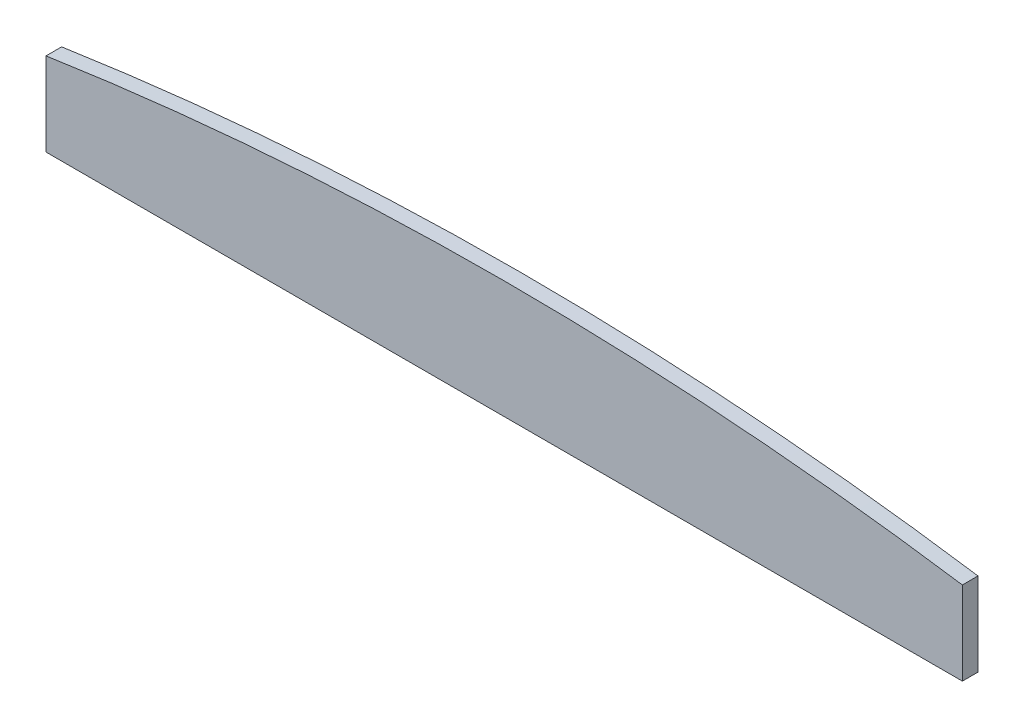
ISO-10303-21;
HEADER;
FILE_DESCRIPTION(('STEP AP214'),'2;1');
FILE_NAME('part.step','',(''),(''),'','','');
FILE_SCHEMA(('AUTOMOTIVE_DESIGN { 1 0 10303 214 1 1 1 1 }'));
ENDSEC;
DATA;
#1=APPLICATION_CONTEXT('core data for automotive mechanical design processes');
#2=APPLICATION_PROTOCOL_DEFINITION('international standard','automotive_design',2000,#1);
#3=PRODUCT_CONTEXT('',#1,'mechanical');
#4=PRODUCT('Part','Part','',(#3));
#5=PRODUCT_RELATED_PRODUCT_CATEGORY('part','',(#4));
#6=PRODUCT_DEFINITION_FORMATION('','',#4);
#7=PRODUCT_DEFINITION_CONTEXT('part definition',#1,'design');
#8=PRODUCT_DEFINITION('design','',#6,#7);
#9=PRODUCT_DEFINITION_SHAPE('','',#8);
#10=(LENGTH_UNIT() NAMED_UNIT(*) SI_UNIT(.MILLI.,.METRE.));
#11=(NAMED_UNIT(*) PLANE_ANGLE_UNIT() SI_UNIT($,.RADIAN.));
#12=(NAMED_UNIT(*) SI_UNIT($,.STERADIAN.) SOLID_ANGLE_UNIT());
#13=UNCERTAINTY_MEASURE_WITH_UNIT(LENGTH_MEASURE(1.E-05),#10,'distance_accuracy_value','');
#14=(GEOMETRIC_REPRESENTATION_CONTEXT(3) GLOBAL_UNCERTAINTY_ASSIGNED_CONTEXT((#13)) GLOBAL_UNIT_ASSIGNED_CONTEXT((#10,
#11,#12)) REPRESENTATION_CONTEXT('',''));
#15=CARTESIAN_POINT('',(0.,0.,0.));
#16=DIRECTION('',(0.,0.,1.));
#17=DIRECTION('',(1.,0.,0.));
#18=AXIS2_PLACEMENT_3D('',#15,#16,#17);
#19=CARTESIAN_POINT('',(58.7,16.,-1.));
#20=DIRECTION('',(-1.,0.,0.));
#21=DIRECTION('',(0.,0.,1.));
#22=AXIS2_PLACEMENT_3D('',#19,#20,#21);
#23=PLANE('',#22);
#24=DIRECTION('',(0.,-1.,0.));
#25=VECTOR('',#24,1.);
#26=CARTESIAN_POINT('',(58.7,16.,-1.));
#27=LINE('',#26,#25);
#28=CARTESIAN_POINT('',(58.7,10.6746827832801,-1.));
#29=VERTEX_POINT('',#28);
#30=CARTESIAN_POINT('',(58.7,0.,-1.));
#31=VERTEX_POINT('',#30);
#32=EDGE_CURVE('E11',#29,#31,#27,.T.);
#33=ORIENTED_EDGE('',*,*,#32,.F.);
#34=DIRECTION('',(0.,0.,1.));
#35=VECTOR('',#34,1.);
#36=CARTESIAN_POINT('',(58.7,10.6746827832801,-19.));
#37=LINE('',#36,#35);
#38=CARTESIAN_POINT('',(58.7,10.6746827832801,1.));
#39=VERTEX_POINT('',#38);
#40=EDGE_CURVE('E76',#29,#39,#37,.T.);
#41=ORIENTED_EDGE('',*,*,#40,.T.);
#42=DIRECTION('',(0.,-1.,0.));
#43=VECTOR('',#42,1.);
#44=CARTESIAN_POINT('',(58.7,16.,1.));
#45=LINE('',#44,#43);
#46=CARTESIAN_POINT('',(58.7,0.,1.));
#47=VERTEX_POINT('',#46);
#48=EDGE_CURVE('E58',#39,#47,#45,.T.);
#49=ORIENTED_EDGE('',*,*,#48,.T.);
#50=DIRECTION('',(0.,0.,-1.));
#51=VECTOR('',#50,1.);
#52=CARTESIAN_POINT('',(58.7,0.,-1.));
#53=LINE('',#52,#51);
#54=EDGE_CURVE('E104',#47,#31,#53,.T.);
#55=ORIENTED_EDGE('',*,*,#54,.T.);
#56=EDGE_LOOP('',(#33,#41,#49,#55));
#57=FACE_BOUND('',#56,.T.);
#58=ADVANCED_FACE('F36',(#57),#23,.F.);
#59=CARTESIAN_POINT('',(-58.7,16.,-1.));
#60=DIRECTION('',(0.,0.,1.));
#61=DIRECTION('',(1.,0.,0.));
#62=AXIS2_PLACEMENT_3D('',#59,#60,#61);
#63=PLANE('',#62);
#64=DIRECTION('',(0.,-1.,0.));
#65=VECTOR('',#64,1.);
#66=CARTESIAN_POINT('',(-58.7,16.,-1.));
#67=LINE('',#66,#65);
#68=CARTESIAN_POINT('',(-58.7,10.6746827832801,-0.999999999999997));
#69=VERTEX_POINT('',#68);
#70=CARTESIAN_POINT('',(-58.7,0.,-1.));
#71=VERTEX_POINT('',#70);
#72=EDGE_CURVE('E43',#69,#71,#67,.T.);
#73=ORIENTED_EDGE('',*,*,#72,.F.);
#74=CARTESIAN_POINT('',(0.,-379.676965642301,-1.));
#75=DIRECTION('',(0.,0.,1.));
#76=DIRECTION('',(1.,0.,0.));
#77=AXIS2_PLACEMENT_3D('',#74,#75,#76);
#78=CIRCLE('',#77,394.740546978098);
#79=EDGE_CURVE('E109',#69,#29,#78,.F.);
#80=ORIENTED_EDGE('',*,*,#79,.T.);
#81=ORIENTED_EDGE('',*,*,#32,.T.);
#82=DIRECTION('',(-1.,0.,0.));
#83=VECTOR('',#82,1.);
#84=CARTESIAN_POINT('',(-58.7,0.,-1.));
#85=LINE('',#84,#83);
#86=EDGE_CURVE('E101',#31,#71,#85,.T.);
#87=ORIENTED_EDGE('',*,*,#86,.T.);
#88=EDGE_LOOP('',(#73,#80,#81,#87));
#89=FACE_BOUND('',#88,.T.);
#90=ADVANCED_FACE('F102',(#89),#63,.F.);
#91=CARTESIAN_POINT('',(-58.7,16.,-1.));
#92=DIRECTION('',(1.,0.,0.));
#93=DIRECTION('',(0.,0.,-1.));
#94=AXIS2_PLACEMENT_3D('',#91,#92,#93);
#95=PLANE('',#94);
#96=DIRECTION('',(0.,-1.,0.));
#97=VECTOR('',#96,1.);
#98=CARTESIAN_POINT('',(-58.7,16.,1.));
#99=LINE('',#98,#97);
#100=CARTESIAN_POINT('',(-58.7,10.6746827832801,1.));
#101=VERTEX_POINT('',#100);
#102=CARTESIAN_POINT('',(-58.7,0.,1.));
#103=VERTEX_POINT('',#102);
#104=EDGE_CURVE('E87',#101,#103,#99,.T.);
#105=ORIENTED_EDGE('',*,*,#104,.F.);
#106=DIRECTION('',(0.,0.,1.));
#107=VECTOR('',#106,1.);
#108=CARTESIAN_POINT('',(-58.7,10.6746827832801,-19.));
#109=LINE('',#108,#107);
#110=EDGE_CURVE('E50',#69,#101,#109,.T.);
#111=ORIENTED_EDGE('',*,*,#110,.F.);
#112=ORIENTED_EDGE('',*,*,#72,.T.);
#113=DIRECTION('',(0.,0.,1.));
#114=VECTOR('',#113,1.);
#115=CARTESIAN_POINT('',(-58.7,0.,-1.));
#116=LINE('',#115,#114);
#117=EDGE_CURVE('E90',#71,#103,#116,.T.);
#118=ORIENTED_EDGE('',*,*,#117,.T.);
#119=EDGE_LOOP('',(#105,#111,#112,#118));
#120=FACE_BOUND('',#119,.T.);
#121=ADVANCED_FACE('F97',(#120),#95,.F.);
#122=CARTESIAN_POINT('',(-58.7,16.,1.));
#123=DIRECTION('',(0.,0.,-1.));
#124=DIRECTION('',(-1.,0.,0.));
#125=AXIS2_PLACEMENT_3D('',#122,#123,#124);
#126=PLANE('',#125);
#127=ORIENTED_EDGE('',*,*,#48,.F.);
#128=CARTESIAN_POINT('',(0.,-379.676965642301,1.));
#129=DIRECTION('',(0.,0.,-1.));
#130=DIRECTION('',(-1.,0.,0.));
#131=AXIS2_PLACEMENT_3D('',#128,#129,#130);
#132=CIRCLE('',#131,394.740546978098);
#133=EDGE_CURVE('E74',#101,#39,#132,.T.);
#134=ORIENTED_EDGE('',*,*,#133,.F.);
#135=ORIENTED_EDGE('',*,*,#104,.T.);
#136=DIRECTION('',(1.,0.,0.));
#137=VECTOR('',#136,1.);
#138=CARTESIAN_POINT('',(-58.7,0.,1.));
#139=LINE('',#138,#137);
#140=EDGE_CURVE('E85',#103,#47,#139,.T.);
#141=ORIENTED_EDGE('',*,*,#140,.T.);
#142=EDGE_LOOP('',(#127,#134,#135,#141));
#143=FACE_BOUND('',#142,.T.);
#144=ADVANCED_FACE('F83',(#143),#126,.F.);
#145=CARTESIAN_POINT('',(0.,0.,0.));
#146=DIRECTION('',(0.,1.,0.));
#147=DIRECTION('',(0.,0.,1.));
#148=AXIS2_PLACEMENT_3D('',#145,#146,#147);
#149=PLANE('',#148);
#150=ORIENTED_EDGE('',*,*,#54,.F.);
#151=ORIENTED_EDGE('',*,*,#140,.F.);
#152=ORIENTED_EDGE('',*,*,#117,.F.);
#153=ORIENTED_EDGE('',*,*,#86,.F.);
#154=EDGE_LOOP('',(#150,#151,#152,#153));
#155=FACE_BOUND('',#154,.T.);
#156=ADVANCED_FACE('F106',(#155),#149,.F.);
#157=CARTESIAN_POINT('',(0.,-379.676965642301,-19.));
#158=DIRECTION('',(0.,0.,1.));
#159=DIRECTION('',(1.,0.,0.));
#160=AXIS2_PLACEMENT_3D('',#157,#158,#159);
#161=CYLINDRICAL_SURFACE('',#160,394.740546978098);
#162=ORIENTED_EDGE('',*,*,#110,.T.);
#163=ORIENTED_EDGE('',*,*,#133,.T.);
#164=ORIENTED_EDGE('',*,*,#40,.F.);
#165=ORIENTED_EDGE('',*,*,#79,.F.);
#166=EDGE_LOOP('',(#162,#163,#164,#165));
#167=FACE_BOUND('',#166,.T.);
#168=ADVANCED_FACE('F75',(#167),#161,.T.);
#169=CLOSED_SHELL('',(#58,#90,#121,#144,#156,#168));
#170=MANIFOLD_SOLID_BREP('B2',#169);
#171=ADVANCED_BREP_SHAPE_REPRESENTATION('',(#18,#170),#14);
#172=SHAPE_DEFINITION_REPRESENTATION(#9,#171);
ENDSEC;
END-ISO-10303-21;
